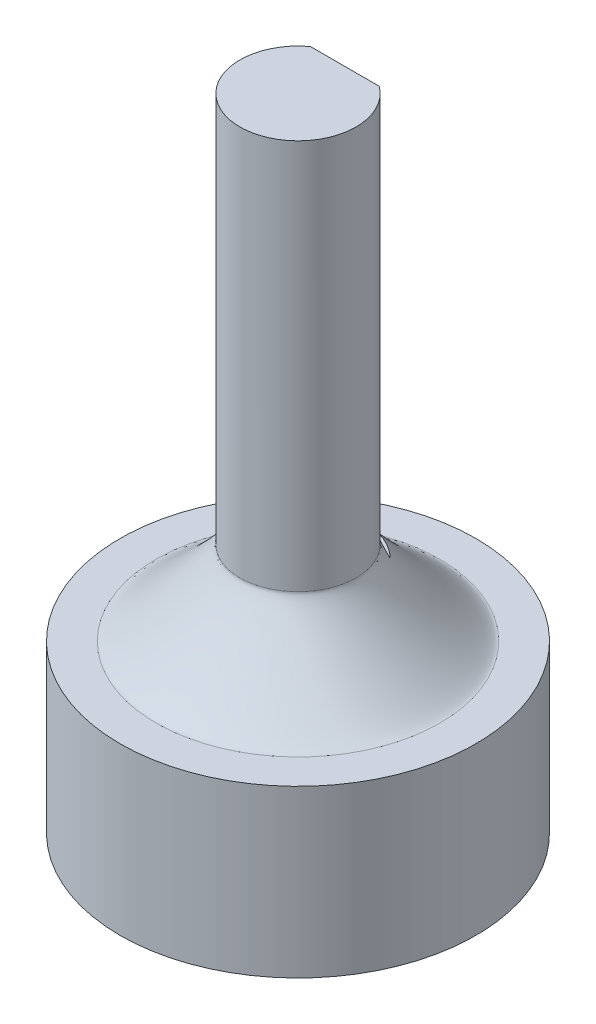
ISO-10303-21;
HEADER;
FILE_DESCRIPTION(('STEP AP214'),'2;1');
FILE_NAME('part.step','',(''),(''),'','','');
FILE_SCHEMA(('AUTOMOTIVE_DESIGN { 1 0 10303 214 1 1 1 1 }'));
ENDSEC;
DATA;
#1=APPLICATION_CONTEXT('core data for automotive mechanical design processes');
#2=APPLICATION_PROTOCOL_DEFINITION('international standard','automotive_design',2000,#1);
#3=PRODUCT_CONTEXT('',#1,'mechanical');
#4=PRODUCT('Part','Part','',(#3));
#5=PRODUCT_RELATED_PRODUCT_CATEGORY('part','',(#4));
#6=PRODUCT_DEFINITION_FORMATION('','',#4);
#7=PRODUCT_DEFINITION_CONTEXT('part definition',#1,'design');
#8=PRODUCT_DEFINITION('design','',#6,#7);
#9=PRODUCT_DEFINITION_SHAPE('','',#8);
#10=(LENGTH_UNIT() NAMED_UNIT(*) SI_UNIT(.MILLI.,.METRE.));
#11=(NAMED_UNIT(*) PLANE_ANGLE_UNIT() SI_UNIT($,.RADIAN.));
#12=(NAMED_UNIT(*) SI_UNIT($,.STERADIAN.) SOLID_ANGLE_UNIT());
#13=UNCERTAINTY_MEASURE_WITH_UNIT(LENGTH_MEASURE(1.E-05),#10,'distance_accuracy_value','');
#14=(GEOMETRIC_REPRESENTATION_CONTEXT(3) GLOBAL_UNCERTAINTY_ASSIGNED_CONTEXT((#13)) GLOBAL_UNIT_ASSIGNED_CONTEXT((#10,
#11,#12)) REPRESENTATION_CONTEXT('',''));
#15=CARTESIAN_POINT('',(0.,0.,0.));
#16=DIRECTION('',(0.,0.,1.));
#17=DIRECTION('',(1.,0.,0.));
#18=AXIS2_PLACEMENT_3D('',#15,#16,#17);
#19=CARTESIAN_POINT('',(-3.54245884228672,2.,-4.82468667270477));
#20=CARTESIAN_POINT('',(-2.91090883660745,2.,-5.28839344865424));
#21=CARTESIAN_POINT('',(-2.18740658779345,2.,-5.62634410096733));
#22=CARTESIAN_POINT('',(-0.665548538517678,2.,-5.9997950519732));
#23=CARTESIAN_POINT('',(0.132208496483373,2.,-6.03514841874369));
#24=CARTESIAN_POINT('',(1.68113549134606,2.,-5.7977822469065));
#25=CARTESIAN_POINT('',(2.43169603564322,2.,-5.52515609852376));
#26=CARTESIAN_POINT('',(3.77188188218393,2.,-4.71310965177444));
#27=CARTESIAN_POINT('',(4.36097989675496,2.,-4.17400884796719));
#28=CARTESIAN_POINT('',(5.28839344865458,2.,-2.91090883660626));
#29=CARTESIAN_POINT('',(5.62634410096693,2.,-2.18740658779251));
#30=CARTESIAN_POINT('',(5.99979505197361,2.,-0.665548538518613));
#31=CARTESIAN_POINT('',(6.03514841874339,2.,0.132208496483121));
#32=CARTESIAN_POINT('',(5.7977822469068,2.,1.68113549134632));
#33=CARTESIAN_POINT('',(5.52515609852315,2.,2.43169603564265));
#34=CARTESIAN_POINT('',(4.71310965177505,2.,3.7718818821845));
#35=CARTESIAN_POINT('',(4.17400884796728,2.,4.36097989675459));
#36=CARTESIAN_POINT('',(2.91090883660617,2.,5.28839344865495));
#37=CARTESIAN_POINT('',(2.18740658779261,2.,5.62634410096717));
#38=CARTESIAN_POINT('',(0.665548538518531,2.,5.99979505197336));
#39=CARTESIAN_POINT('',(-0.13220849648313,2.,6.03514841874323));
#40=CARTESIAN_POINT('',(-1.68113549134631,2.,5.79778224690695));
#41=CARTESIAN_POINT('',(-2.43169603564247,2.,5.52515609852281));
#42=CARTESIAN_POINT('',(-3.77188188218467,2.,4.71310965177539));
#43=CARTESIAN_POINT('',(-4.36097989675507,2.,4.17400884796725));
#44=CARTESIAN_POINT('',(-5.28839344865449,2.,2.91090883660618));
#45=CARTESIAN_POINT('',(-5.62634410096735,2.,2.1874065877926));
#46=CARTESIAN_POINT('',(-5.99979505197317,2.,0.665548538518547));
#47=CARTESIAN_POINT('',(-6.03514841874389,2.,-0.132208496483173));
#48=CARTESIAN_POINT('',(-5.7977822469063,2.,-1.68113549134623));
#49=CARTESIAN_POINT('',(-5.52515609852287,2.,-2.43169603564272));
#50=CARTESIAN_POINT('',(-4.71310965177533,2.,-3.77188188218441));
#51=CARTESIAN_POINT('',(-4.174008847966,2.,-4.36097989675531));
#52=CARTESIAN_POINT('',(-3.54245884228672,2.,-4.82468667270477));
#53=CARTESIAN_POINT('',(-1.45,2.,-1.97484176581315));
#54=CARTESIAN_POINT('',(-1.19149381855818,1.99999999999932,-2.16464632108444));
#55=CARTESIAN_POINT('',(-0.895349725574461,1.99999999999966,-2.30297635332165));
#56=CARTESIAN_POINT('',(-0.272422468069648,2.00000000000034,-2.45583737530355));
#57=CARTESIAN_POINT('',(0.0541156096473972,1.99999999999966,-2.47030822284155));
#58=CARTESIAN_POINT('',(0.688122733665404,2.00000000000034,-2.37314945135322));
#59=CARTESIAN_POINT('',(0.995342333859187,1.99999999999949,-2.26155805883305));
#60=CARTESIAN_POINT('',(1.54390748704849,2.00000000000051,-1.9291710360883));
#61=CARTESIAN_POINT('',(1.78503721054152,2.00000000000034,-1.70850618144233));
#62=CARTESIAN_POINT('',(2.16464632108478,1.99999999999966,-1.19149381855767));
#63=CARTESIAN_POINT('',(2.30297635332196,2.,-0.895349725574181));
#64=CARTESIAN_POINT('',(2.45583737530323,2.,-0.272422468069926));
#65=CARTESIAN_POINT('',(2.47030822284174,2.00000000000034,0.0541156096472936));
#66=CARTESIAN_POINT('',(2.37314945135304,1.99999999999966,0.688122733665511));
#67=CARTESIAN_POINT('',(2.26155805883312,1.99999999999949,0.995342333859115));
#68=CARTESIAN_POINT('',(1.92917103608824,2.00000000000051,1.54390748704856));
#69=CARTESIAN_POINT('',(1.70850618144284,2.,1.78503721054165));
#70=CARTESIAN_POINT('',(1.19149381855716,2.,2.16464632108465));
#71=CARTESIAN_POINT('',(0.89534972557428,2.,2.30297635332206));
#72=CARTESIAN_POINT('',(0.272422468069834,2.,2.45583737530313));
#73=CARTESIAN_POINT('',(-0.0541156096472479,2.00000000000068,2.47030822284184));
#74=CARTESIAN_POINT('',(-0.688122733665557,1.99999999999932,2.37314945135293));
#75=CARTESIAN_POINT('',(-0.995342333859451,1.99999999999949,2.26155805883329));
#76=CARTESIAN_POINT('',(-1.54390748704822,2.00000000000051,1.92917103608807));
#77=CARTESIAN_POINT('',(-1.785037210542,2.,1.70850618144267));
#78=CARTESIAN_POINT('',(-2.16464632108431,2.,1.19149381855732));
#79=CARTESIAN_POINT('',(-2.3029763533222,2.,0.895349725574387));
#80=CARTESIAN_POINT('',(-2.455837375303,2.,0.272422468069729));
#81=CARTESIAN_POINT('',(-2.47030822284163,1.99999999999966,-0.0541156096472029));
#82=CARTESIAN_POINT('',(-2.37314945135315,2.00000000000034,-0.688122733665584));
#83=CARTESIAN_POINT('',(-2.26155805883339,1.99999999999932,-0.995342333859317));
#84=CARTESIAN_POINT('',(-1.92917103608797,2.00000000000068,-1.54390748704835));
#85=CARTESIAN_POINT('',(-1.70850618144182,2.00000000000068,-1.78503721054186));
#86=CARTESIAN_POINT('',(-1.45,2.,-1.97484176581315));
#87=CARTESIAN_POINT('',(-1.45,5.53553390593274,-1.97484176581315));
#88=CARTESIAN_POINT('',(-1.19149381855798,5.53553390593274,-2.16464632108423));
#89=CARTESIAN_POINT('',(-0.895349725574511,5.53553390593274,-2.30297635332185));
#90=CARTESIAN_POINT('',(-0.272422468069598,5.53553390593274,-2.45583737530335));
#91=CARTESIAN_POINT('',(0.0541156096472806,5.53553390593274,-2.47030822284148));
#92=CARTESIAN_POINT('',(0.688122733665521,5.53553390593274,-2.37314945135329));
#93=CARTESIAN_POINT('',(0.995342333859261,5.5355339059324,-2.26155805883318));
#94=CARTESIAN_POINT('',(1.54390748704841,5.53553390593308,-1.92917103608818));
#95=CARTESIAN_POINT('',(1.78503721054175,5.53553390593308,-1.70850618144245));
#96=CARTESIAN_POINT('',(2.16464632108455,5.5355339059324,-1.19149381855755));
#97=CARTESIAN_POINT('',(2.30297635332192,5.5355339059324,-0.895349725574213));
#98=CARTESIAN_POINT('',(2.45583737530327,5.53553390593308,-0.272422468069894));
#99=CARTESIAN_POINT('',(2.47030822284148,5.53553390593308,0.0541156096472808));
#100=CARTESIAN_POINT('',(2.37314945135329,5.5355339059324,0.688122733665524));
#101=CARTESIAN_POINT('',(2.26155805883323,5.53553390593274,0.995342333859168));
#102=CARTESIAN_POINT('',(1.92917103608812,5.53553390593274,1.54390748704851));
#103=CARTESIAN_POINT('',(1.70850618144253,5.53553390593274,1.78503721054169));
#104=CARTESIAN_POINT('',(1.19149381855747,5.53553390593274,2.16464632108461));
#105=CARTESIAN_POINT('',(0.895349725574204,5.53553390593274,2.30297635332192));
#106=CARTESIAN_POINT('',(0.272422468069912,5.53553390593274,2.45583737530327));
#107=CARTESIAN_POINT('',(-0.0541156096472871,5.53553390593274,2.47030822284148));
#108=CARTESIAN_POINT('',(-0.688122733665518,5.53553390593274,2.37314945135329));
#109=CARTESIAN_POINT('',(-0.995342333859165,5.5355339059324,2.26155805883323));
#110=CARTESIAN_POINT('',(-1.5439074870485,5.53553390593308,1.92917103608812));
#111=CARTESIAN_POINT('',(-1.78503721054175,5.5355339059324,1.70850618144245));
#112=CARTESIAN_POINT('',(-2.16464632108455,5.53553390593308,1.19149381855755));
#113=CARTESIAN_POINT('',(-2.30297635332194,5.5355339059324,0.895349725574152));
#114=CARTESIAN_POINT('',(-2.45583737530326,5.53553390593308,0.272422468069964));
#115=CARTESIAN_POINT('',(-2.47030822284148,5.53553390593274,-0.0541156096472906));
#116=CARTESIAN_POINT('',(-2.3731494513533,5.53553390593274,-0.688122733665497));
#117=CARTESIAN_POINT('',(-2.2615580588332,5.5355339059324,-0.995342333859221));
#118=CARTESIAN_POINT('',(-1.92917103608816,5.53553390593308,-1.54390748704845));
#119=CARTESIAN_POINT('',(-1.70850618144202,5.53553390593274,-1.78503721054207));
#120=CARTESIAN_POINT('',(-1.45,5.53553390593274,-1.97484176581315));
#121=(BOUNDED_SURFACE() B_SPLINE_SURFACE(2,3,((#19,#20,#21,#22,#23,#24,#25,#26,#27,#28,#29,#30,
#31,#32,#33,#34,#35,#36,#37,#38,#39,#40,#41,#42,#43,#44,#45,#46,#47,#48,#49,#50,#51,#52),(#53,
#54,#55,#56,#57,#58,#59,#60,#61,#62,#63,#64,#65,#66,#67,#68,#69,#70,#71,#72,#73,#74,#75,#76,#77,
#78,#79,#80,#81,#82,#83,#84,#85,#86),(#87,#88,#89,#90,#91,#92,#93,#94,#95,#96,#97,#98,#99,#100,
#101,#102,#103,#104,#105,#106,#107,#108,#109,#110,#111,#112,#113,#114,#115,#116,#117,#118,#119,
#120)),.UNSPECIFIED.,.F.,.T.,.F.) B_SPLINE_SURFACE_WITH_KNOTS((3,3),(4,2,2,2,2,2,2,2,2,2,2,2,2,
2,2,2,4),(0.,1.),(-0.633335603311312,-0.240636521612588,0.152062560086137,0.544761641784861,
0.937460723483585,1.33015980518231,1.72285888688103,2.11555796857976,2.50825705027848,
2.90095613197721,3.29365521367593,3.68635429537465,4.07905337707338,4.4717524587721,
4.86445154047083,5.25715062216955,5.64984970386827),
.UNSPECIFIED.) GEOMETRIC_REPRESENTATION_ITEM() RATIONAL_B_SPLINE_SURFACE(((1.,1.,1.,1.,1.,1.,1.,
1.,1.,1.,1.,1.,1.,1.,1.,1.,1.,1.,1.,1.,1.,1.,1.,1.,1.,1.,1.,1.,1.,1.,1.,1.,1.,1.),(0.125,0.125,
0.125,0.125,0.125,0.125,0.125,0.125,0.125,0.125,0.125,0.125,0.125,0.125,0.125,0.125,0.125,0.125,
0.125,0.125,0.125,0.125,0.125,0.125,0.125,0.125,0.125,0.125,0.125,0.125,0.125,0.125,0.125,
0.125),(1.,1.,1.,1.,1.,1.,1.,1.,1.,1.,1.,1.,1.,1.,1.,1.,1.,1.,1.,1.,1.,1.,1.,1.,1.,1.,1.,1.,1.,
1.,1.,1.,1.,1.))) REPRESENTATION_ITEM('') SURFACE());
#122=CARTESIAN_POINT('',(-3.54245884228672,2.,-4.82468667270477));
#123=CARTESIAN_POINT('',(-4.174008847966,2.,-4.36097989675531));
#124=CARTESIAN_POINT('',(-4.71310965177533,2.,-3.77188188218441));
#125=CARTESIAN_POINT('',(-5.52515609852287,2.,-2.43169603564272));
#126=CARTESIAN_POINT('',(-5.7977822469063,2.,-1.68113549134623));
#127=CARTESIAN_POINT('',(-6.03514841874389,2.,-0.132208496483173));
#128=CARTESIAN_POINT('',(-5.99979505197317,2.,0.665548538518547));
#129=CARTESIAN_POINT('',(-5.62634410096735,2.,2.1874065877926));
#130=CARTESIAN_POINT('',(-5.28839344865449,2.,2.91090883660618));
#131=CARTESIAN_POINT('',(-4.36097989675507,2.,4.17400884796725));
#132=CARTESIAN_POINT('',(-3.77188188218467,2.,4.71310965177539));
#133=CARTESIAN_POINT('',(-2.43169603564247,2.,5.52515609852281));
#134=CARTESIAN_POINT('',(-1.68113549134631,2.,5.79778224690695));
#135=CARTESIAN_POINT('',(-0.13220849648313,2.,6.03514841874323));
#136=CARTESIAN_POINT('',(0.665548538518531,2.,5.99979505197336));
#137=CARTESIAN_POINT('',(2.18740658779261,2.,5.62634410096717));
#138=CARTESIAN_POINT('',(2.91090883660617,2.,5.28839344865495));
#139=CARTESIAN_POINT('',(4.17400884796728,2.,4.36097989675459));
#140=CARTESIAN_POINT('',(4.71310965177505,2.,3.7718818821845));
#141=CARTESIAN_POINT('',(5.52515609852315,2.,2.43169603564265));
#142=CARTESIAN_POINT('',(5.7977822469068,2.,1.68113549134632));
#143=CARTESIAN_POINT('',(6.03514841874339,2.,0.132208496483121));
#144=CARTESIAN_POINT('',(5.99979505197361,2.,-0.665548538518613));
#145=CARTESIAN_POINT('',(5.62634410096693,2.,-2.18740658779251));
#146=CARTESIAN_POINT('',(5.28839344865458,2.,-2.91090883660626));
#147=CARTESIAN_POINT('',(4.36097989675496,2.,-4.17400884796719));
#148=CARTESIAN_POINT('',(3.77188188218393,2.,-4.71310965177444));
#149=CARTESIAN_POINT('',(2.43169603564322,2.,-5.52515609852376));
#150=CARTESIAN_POINT('',(1.68113549134606,2.,-5.7977822469065));
#151=CARTESIAN_POINT('',(0.132208496483373,2.,-6.03514841874369));
#152=CARTESIAN_POINT('',(-0.665548538517678,2.,-5.9997950519732));
#153=CARTESIAN_POINT('',(-2.18740658779345,2.,-5.62634410096733));
#154=CARTESIAN_POINT('',(-2.91090883660745,2.,-5.28839344865424));
#155=CARTESIAN_POINT('',(-3.54245884228672,2.,-4.82468667270477));
#156=(BOUNDED_CURVE() B_SPLINE_CURVE(3,(#122,#123,#124,#125,#126,#127,#128,#129,#130,#131,#132,
#133,#134,#135,#136,#137,#138,#139,#140,#141,#142,#143,#144,#145,#146,#147,#148,#149,#150,#151,
#152,#153,#154,#155),.UNSPECIFIED.,.T.,.F.) B_SPLINE_CURVE_WITH_KNOTS((4,2,2,2,2,2,2,2,2,2,2,2,
2,2,2,2,4),(-0.633335603311312,-0.240636521612588,0.152062560086137,0.544761641784861,
0.937460723483585,1.33015980518231,1.72285888688103,2.11555796857976,2.50825705027848,
2.90095613197721,3.29365521367593,3.68635429537465,4.07905337707338,4.4717524587721,
4.86445154047083,5.25715062216955,5.64984970386827),
.UNSPECIFIED.) CURVE() GEOMETRIC_REPRESENTATION_ITEM() RATIONAL_B_SPLINE_CURVE((1.,1.,1.,1.,1.,
1.,1.,1.,1.,1.,1.,1.,1.,1.,1.,1.,1.,1.,1.,1.,1.,1.,1.,1.,1.,1.,1.,1.,1.,1.,1.,1.,1.,1.)) REPRESENTATION_ITEM(''));
#157=CARTESIAN_POINT('',(-3.54245884228672,2.,-4.82468667270477));
#158=VERTEX_POINT('',#157);
#159=EDGE_CURVE('E95',#158,#158,#156,.F.);
#160=CARTESIAN_POINT('',(1.91184602612636,5.,-1.97484176581315));
#161=CARTESIAN_POINT('',(1.88680357612926,5.02339623919845,-1.97484794887301));
#162=CARTESIAN_POINT('',(1.8618287081679,5.04686610739691,-1.97483242277833));
#163=CARTESIAN_POINT('',(1.81515989565718,5.09110053013634,-1.97481128158017));
#164=CARTESIAN_POINT('',(1.79344248675847,5.11184035915349,-1.97480467758503));
#165=CARTESIAN_POINT('',(1.74952796060595,5.15418321556764,-1.97483339058196));
#166=CARTESIAN_POINT('',(1.72733723724839,5.17579287674663,-1.97487003252018));
#167=CARTESIAN_POINT('',(1.67764088249705,5.2251582501401,-1.97480610985935));
#168=CARTESIAN_POINT('',(1.65026229867812,5.25304389274728,-1.97466717390624));
#169=CARTESIAN_POINT('',(1.6091585252585,5.29675089798885,-1.97433794888741));
#170=CARTESIAN_POINT('',(1.59499723963603,5.31216103811409,-1.97420147021734));
#171=CARTESIAN_POINT('',(1.56885640984317,5.34151284191463,-1.97396658116938));
#172=CARTESIAN_POINT('',(1.55682123491063,5.35540471815271,-1.97386555869407));
#173=CARTESIAN_POINT('',(1.53485303496427,5.38178768100575,-1.97372940709573));
#174=CARTESIAN_POINT('',(1.52485225032561,5.39422157073211,-1.97368733941689));
#175=CARTESIAN_POINT('',(1.51086709072542,5.41255565197234,-1.97368272781208));
#176=CARTESIAN_POINT('',(1.50662130856737,5.41825608796827,-1.97368902415611));
#177=CARTESIAN_POINT('',(1.49862277862797,5.42932743069636,-1.97371911165859));
#178=CARTESIAN_POINT('',(1.49485745032237,5.43468921166315,-1.973741495055));
#179=CARTESIAN_POINT('',(1.4878117645368,5.44509241847221,-1.97380202764636));
#180=CARTESIAN_POINT('',(1.48451696736338,5.45012401935043,-1.97383873209881));
#181=CARTESIAN_POINT('',(1.47840589450154,5.4598766381629,-1.97392512935442));
#182=CARTESIAN_POINT('',(1.47557284261243,5.46458710025476,-1.97397343187672));
#183=CARTESIAN_POINT('',(1.47037883879464,5.47370774891133,-1.97407931170528));
#184=CARTESIAN_POINT('',(1.46799835430137,5.47810668134957,-1.97413565896112));
#185=CARTESIAN_POINT('',(1.46470038356565,5.48464290853909,-1.97422568356153));
#186=CARTESIAN_POINT('',(1.46368223766855,5.48672953859014,-1.97425533737306));
#187=CARTESIAN_POINT('',(1.46175970647545,5.49082983188148,-1.97431495406849));
#188=CARTESIAN_POINT('',(1.46085218730617,5.49284202016597,-1.97434482962513));
#189=CARTESIAN_POINT('',(1.45915015565123,5.49679451550384,-1.97440419076644));
#190=CARTESIAN_POINT('',(1.45835225711912,5.49873335963194,-1.97443362062873));
#191=CARTESIAN_POINT('',(1.45686884449749,5.5025403281212,-1.97449133190098));
#192=CARTESIAN_POINT('',(1.4561796754099,5.50440702147104,-1.97451959541101));
#193=CARTESIAN_POINT('',(1.4549131083457,5.5080708162991,-1.97457416951046));
#194=CARTESIAN_POINT('',(1.45433178188604,5.50986655046165,-1.97460050571059));
#195=CARTESIAN_POINT('',(1.45328033671707,5.51338946798061,-1.97465037099128));
#196=CARTESIAN_POINT('',(1.45280601976821,5.51511538959881,-1.97467397481038));
#197=CARTESIAN_POINT('',(1.45196798632763,5.51849987928678,-1.97471748260183));
#198=CARTESIAN_POINT('',(1.45159982595356,5.52015732779611,-1.9747375146355));
#199=CARTESIAN_POINT('',(1.45112415316617,5.52262482464821,-1.97476441249167));
#200=CARTESIAN_POINT('',(1.45098056611556,5.5234279802828,-1.97477271361973));
#201=CARTESIAN_POINT('',(1.4507202530644,5.52501765659724,-1.9747880534123));
#202=CARTESIAN_POINT('',(1.4506029355839,5.5258040793526,-1.97479511886713));
#203=CARTESIAN_POINT('',(1.45039506875083,5.52736039650827,-1.97480786878089));
#204=CARTESIAN_POINT('',(1.45030392159153,5.52813021049421,-1.97481358344356));
#205=CARTESIAN_POINT('',(1.45014830573838,5.52965343814567,-1.97482350912342));
#206=CARTESIAN_POINT('',(1.45008323636543,5.53040678983594,-1.97482775364709));
#207=CARTESIAN_POINT('',(1.44997967824208,5.53189722552849,-1.97483461662928));
#208=CARTESIAN_POINT('',(1.44994059032394,5.53263426711393,-1.97483727159047));
#209=CARTESIAN_POINT('',(1.44988891104354,5.53409216742247,-1.97484082439642));
#210=CARTESIAN_POINT('',(1.44987572655151,5.53481300528498,-1.97484176154074));
#211=CARTESIAN_POINT('',(1.44987571596695,5.53553390593292,-1.97484176581315));
#212=B_SPLINE_CURVE_WITH_KNOTS('',3,(#160,#161,#162,#163,#164,#165,#166,#167,#168,#169,#170,
#171,#172,#173,#174,#175,#176,#177,#178,#179,#180,#181,#182,#183,#184,#185,#186,#187,#188,#189,
#190,#191,#192,#193,#194,#195,#196,#197,#198,#199,#200,#201,#202,#203,#204,#205,#206,#207,#208,
#209,#210,#211),.UNSPECIFIED.,.F.,.F.,(4,2,2,2,2,2,2,2,2,2,2,2,2,2,2,2,2,2,2,2,2,2,2,2,2,4),(0.,
0.102814504881268,0.192902764957441,0.285824298837191,0.403036605044378,0.465816776804255,
0.52094936939923,0.568803266455679,0.590124552232005,0.609777170607509,0.627816817335482,
0.644303356936106,0.659302376584984,0.666267384488883,0.672888981515966,0.679178145468736,
0.685146820344693,0.690808090968652,0.696176383400613,0.701267689698134,0.703715200940444,
0.706100314344898,0.708425579920389,0.710693691371368,0.712907492593485,0.71506998310197),.UNSPECIFIED.);
#213=CARTESIAN_POINT('',(1.45,5.53553390593276,-1.97484176581315));
#214=VERTEX_POINT('',#213);
#215=CARTESIAN_POINT('',(1.91184602612636,5.,-1.97484176581315));
#216=VERTEX_POINT('',#215);
#217=EDGE_CURVE('E12',#214,#216,#212,.F.);
#218=CARTESIAN_POINT('',(-1.45,5.53553390593274,-1.97484176581315));
#219=CARTESIAN_POINT('',(-1.19149381855798,5.53553390593274,-2.16464632108423));
#220=CARTESIAN_POINT('',(-0.895349725574511,5.53553390593274,-2.30297635332185));
#221=CARTESIAN_POINT('',(-0.272422468069598,5.53553390593274,-2.45583737530335));
#222=CARTESIAN_POINT('',(0.0541156096472806,5.53553390593274,-2.47030822284148));
#223=CARTESIAN_POINT('',(0.688122733665521,5.53553390593274,-2.37314945135329));
#224=CARTESIAN_POINT('',(0.995342333859261,5.5355339059324,-2.26155805883318));
#225=CARTESIAN_POINT('',(1.54390748704841,5.53553390593308,-1.92917103608818));
#226=CARTESIAN_POINT('',(1.78503721054175,5.53553390593308,-1.70850618144245));
#227=CARTESIAN_POINT('',(2.16464632108455,5.5355339059324,-1.19149381855755));
#228=CARTESIAN_POINT('',(2.30297635332192,5.5355339059324,-0.895349725574213));
#229=CARTESIAN_POINT('',(2.45583737530327,5.53553390593308,-0.272422468069894));
#230=CARTESIAN_POINT('',(2.47030822284148,5.53553390593308,0.0541156096472808));
#231=CARTESIAN_POINT('',(2.37314945135329,5.5355339059324,0.688122733665524));
#232=CARTESIAN_POINT('',(2.26155805883323,5.53553390593274,0.995342333859168));
#233=CARTESIAN_POINT('',(1.92917103608812,5.53553390593274,1.54390748704851));
#234=CARTESIAN_POINT('',(1.70850618144253,5.53553390593274,1.78503721054169));
#235=CARTESIAN_POINT('',(1.19149381855747,5.53553390593274,2.16464632108461));
#236=CARTESIAN_POINT('',(0.895349725574204,5.53553390593274,2.30297635332192));
#237=CARTESIAN_POINT('',(0.272422468069912,5.53553390593274,2.45583737530327));
#238=CARTESIAN_POINT('',(-0.0541156096472871,5.53553390593274,2.47030822284148));
#239=CARTESIAN_POINT('',(-0.688122733665518,5.53553390593274,2.37314945135329));
#240=CARTESIAN_POINT('',(-0.995342333859165,5.5355339059324,2.26155805883323));
#241=CARTESIAN_POINT('',(-1.5439074870485,5.53553390593308,1.92917103608812));
#242=CARTESIAN_POINT('',(-1.78503721054175,5.5355339059324,1.70850618144245));
#243=CARTESIAN_POINT('',(-2.16464632108455,5.53553390593308,1.19149381855755));
#244=CARTESIAN_POINT('',(-2.30297635332194,5.5355339059324,0.895349725574152));
#245=CARTESIAN_POINT('',(-2.45583737530326,5.53553390593308,0.272422468069964));
#246=CARTESIAN_POINT('',(-2.47030822284148,5.53553390593274,-0.0541156096472906));
#247=CARTESIAN_POINT('',(-2.3731494513533,5.53553390593274,-0.688122733665497));
#248=CARTESIAN_POINT('',(-2.2615580588332,5.5355339059324,-0.995342333859221));
#249=CARTESIAN_POINT('',(-1.92917103608816,5.53553390593308,-1.54390748704845));
#250=CARTESIAN_POINT('',(-1.70850618144202,5.53553390593274,-1.78503721054207));
#251=CARTESIAN_POINT('',(-1.45,5.53553390593274,-1.97484176581315));
#252=(BOUNDED_CURVE() B_SPLINE_CURVE(3,(#218,#219,#220,#221,#222,#223,#224,#225,#226,#227,#228,
#229,#230,#231,#232,#233,#234,#235,#236,#237,#238,#239,#240,#241,#242,#243,#244,#245,#246,#247,
#248,#249,#250,#251),.UNSPECIFIED.,.T.,.F.) B_SPLINE_CURVE_WITH_KNOTS((4,2,2,2,2,2,2,2,2,2,2,2,
2,2,2,2,4),(-0.633335603311312,-0.240636521612588,0.152062560086137,0.544761641784861,
0.937460723483585,1.33015980518231,1.72285888688103,2.11555796857976,2.50825705027848,
2.90095613197721,3.29365521367593,3.68635429537465,4.07905337707338,4.4717524587721,
4.86445154047083,5.25715062216955,5.64984970386827),
.UNSPECIFIED.) CURVE() GEOMETRIC_REPRESENTATION_ITEM() RATIONAL_B_SPLINE_CURVE((1.,1.,1.,1.,1.,
1.,1.,1.,1.,1.,1.,1.,1.,1.,1.,1.,1.,1.,1.,1.,1.,1.,1.,1.,1.,1.,1.,1.,1.,1.,1.,1.,1.,1.)) REPRESENTATION_ITEM(''));
#253=CARTESIAN_POINT('',(-1.45,5.53553390593274,-1.97484176581315));
#254=VERTEX_POINT('',#253);
#255=EDGE_CURVE('E99',#254,#214,#252,.F.);
#256=CARTESIAN_POINT('',(-1.45,5.53553390593274,-1.97484176581315));
#257=CARTESIAN_POINT('',(-1.45000001176557,5.53479501172475,-1.97484176124261));
#258=CARTESIAN_POINT('',(-1.45001379557765,5.53405618568171,-1.97484083230604));
#259=CARTESIAN_POINT('',(-1.45006780134479,5.53256156840017,-1.974837318411));
#260=CARTESIAN_POINT('',(-1.45010865575538,5.5318057998192,-1.97483469387551));
#261=CARTESIAN_POINT('',(-1.45021687738709,5.53027716506437,-1.9748279201267));
#262=CARTESIAN_POINT('',(-1.45028488324515,5.52950434495056,-1.97482373435986));
#263=CARTESIAN_POINT('',(-1.4504475076725,5.52794142726144,-1.97481395970987));
#264=CARTESIAN_POINT('',(-1.45054276610298,5.52715139690397,-1.97480833748856));
#265=CARTESIAN_POINT('',(-1.45075999603743,5.52555388668578,-1.97479581095335));
#266=CARTESIAN_POINT('',(-1.45088260382917,5.52474649394101,-1.97478887682638));
#267=CARTESIAN_POINT('',(-1.45115464407671,5.52311411138783,-1.97477384274969));
#268=CARTESIAN_POINT('',(-1.45130470550266,5.52228922751825,-1.97476571660961));
#269=CARTESIAN_POINT('',(-1.45180194196797,5.51975382133079,-1.97473941615071));
#270=CARTESIAN_POINT('',(-1.45218673321555,5.51805061006835,-1.97471988200091));
#271=CARTESIAN_POINT('',(-1.4530625431721,5.514571423633,-1.97467758780327));
#272=CARTESIAN_POINT('',(-1.45355827124332,5.51279665453346,-1.97465470890495));
#273=CARTESIAN_POINT('',(-1.45465712133548,5.50917281082167,-1.97460653621627));
#274=CARTESIAN_POINT('',(-1.45526468202361,5.50732509136142,-1.9745811788849));
#275=CARTESIAN_POINT('',(-1.45658836542963,5.50355405168417,-1.97452882583303));
#276=CARTESIAN_POINT('',(-1.45730863189511,5.50163219577429,-1.97450181700514));
#277=CARTESIAN_POINT('',(-1.45885895411346,5.49771158751901,-1.97444689408881));
#278=CARTESIAN_POINT('',(-1.45969285654265,5.49571436347374,-1.97441901105214));
#279=CARTESIAN_POINT('',(-1.46147167523852,5.49164175768771,-1.97436303316148));
#280=CARTESIAN_POINT('',(-1.46242014761224,5.48956793431969,-1.97433500725864));
#281=CARTESIAN_POINT('',(-1.46442943314205,5.48534099239709,-1.97427938488552));
#282=CARTESIAN_POINT('',(-1.46549353128442,5.4831894413127,-1.97425188855954));
#283=CARTESIAN_POINT('',(-1.46894142917367,5.47644617936539,-1.97416892568771));
#284=CARTESIAN_POINT('',(-1.47142937074776,5.47190759584441,-1.97411785243365));
#285=CARTESIAN_POINT('',(-1.4768578922109,5.46249349553846,-1.97402358488366));
#286=CARTESIAN_POINT('',(-1.47981884102627,5.45762986485451,-1.97398169534226));
#287=CARTESIAN_POINT('',(-1.48620590925973,5.44755663539702,-1.9739090260259));
#288=CARTESIAN_POINT('',(-1.48964948242342,5.44235815204988,-1.97387968263594));
#289=CARTESIAN_POINT('',(-1.49701344299854,5.43160683019398,-1.97383450144649));
#290=CARTESIAN_POINT('',(-1.50094882484625,5.42606431243958,-1.97382012022035));
#291=CARTESIAN_POINT('',(-1.5093087089248,5.41461712769415,-1.97380629334903));
#292=CARTESIAN_POINT('',(-1.51374625754497,5.4087220293511,-1.97380823027827));
#293=CARTESIAN_POINT('',(-1.52836626049884,5.38975445906392,-1.9738380558961));
#294=CARTESIAN_POINT('',(-1.53881825221344,5.37689015347354,-1.9738952703806));
#295=CARTESIAN_POINT('',(-1.56177786369151,5.34958813999902,-1.97405585916062));
#296=CARTESIAN_POINT('',(-1.57435562561503,5.33521021747401,-1.97416494898494));
#297=CARTESIAN_POINT('',(-1.60167444391009,5.30483016420963,-1.97440064500156));
#298=CARTESIAN_POINT('',(-1.61647315612447,5.28888011267909,-1.9745275779837));
#299=CARTESIAN_POINT('',(-1.65091532290269,5.25260587599242,-1.97475289146924));
#300=CARTESIAN_POINT('',(-1.67068370986026,5.23240058241061,-1.97483137052716));
#301=CARTESIAN_POINT('',(-1.69792341550745,5.20513369309867,-1.97484554580996));
#302=CARTESIAN_POINT('',(-1.70521462879756,5.19789036462017,-1.97484032350452));
#303=CARTESIAN_POINT('',(-1.73143211204277,5.17198252665023,-1.97482269673641));
#304=CARTESIAN_POINT('',(-1.75046720578108,5.15342797292992,-1.97481204087552));
#305=CARTESIAN_POINT('',(-1.79153889786554,5.11375672748384,-1.97480388241077));
#306=CARTESIAN_POINT('',(-1.81360224414342,5.0926678480468,-1.97480856317362));
#307=CARTESIAN_POINT('',(-1.86103369709834,5.04767979331106,-1.97482424522644));
#308=CARTESIAN_POINT('',(-1.88642642623327,5.02380654331137,-1.9748360492574));
#309=CARTESIAN_POINT('',(-1.91188045452628,5.,-1.97484176581315));
#310=B_SPLINE_CURVE_WITH_KNOTS('',3,(#256,#257,#258,#259,#260,#261,#262,#263,#264,#265,#266,
#267,#268,#269,#270,#271,#272,#273,#274,#275,#276,#277,#278,#279,#280,#281,#282,#283,#284,#285,
#286,#287,#288,#289,#290,#291,#292,#293,#294,#295,#296,#297,#298,#299,#300,#301,#302,#303,#304,
#305,#306,#307,#308,#309),.UNSPECIFIED.,.F.,.F.,(4,2,2,2,2,2,2,2,2,2,2,2,2,2,2,2,2,2,2,2,2,2,2,
2,2,2,4),(0.,0.0022164555062978,0.00448661157578769,0.00681364686557002,0.0092005706937674,
0.0116502291844069,0.0141653125806311,0.0194013260993928,0.0249278552303901,0.0307616633471907,
0.036917833361332,0.0434100138140934,0.0502506369549057,0.0574511076802723,0.0729717890167405,
0.0900497885040497,0.108752797956451,0.129142450843827,0.151275948745025,0.200984660103736,
0.258285646091487,0.323552635592188,0.408344649227455,0.43917723439184,0.518921262691833,
0.610483438098127,0.715040271034209),.UNSPECIFIED.);
#311=CARTESIAN_POINT('',(-1.91188045452628,5.,-1.97484176581315));
#312=VERTEX_POINT('',#311);
#313=EDGE_CURVE('E82',#312,#254,#310,.F.);
#314=CARTESIAN_POINT('',(-1.62685688261567,4.99999999999994,-2.21571373709655));
#315=CARTESIAN_POINT('',(-1.33682063401042,4.9999999999999,-2.42866880405836));
#316=CARTESIAN_POINT('',(-1.00455576786134,4.99999999999992,-2.58387098682951));
#317=CARTESIAN_POINT('',(-0.305649908384944,4.99999999999996,-2.75537650799795));
#318=CARTESIAN_POINT('',(0.060716104835617,4.99999999999992,-2.77161236862879));
#319=CARTESIAN_POINT('',(0.772053245067611,4.99999999999996,-2.66260311614462));
#320=CARTESIAN_POINT('',(1.11674450096395,4.99999999999962,-2.53740089203294));
#321=CARTESIAN_POINT('',(1.73221829063898,5.00000000000026,-2.1644725364157));
#322=CARTESIAN_POINT('',(2.00275867013442,5.00000000000025,-1.91689313122142));
#323=CARTESIAN_POINT('',(2.42866880405868,4.99999999999963,-1.33682063400991));
#324=CARTESIAN_POINT('',(2.58387098682956,4.99999999999965,-1.00455576786099));
#325=CARTESIAN_POINT('',(2.7553765079979,5.00000000000023,-0.305649908385294));
#326=CARTESIAN_POINT('',(2.77161236862878,5.00000000000025,0.060716104835589));
#327=CARTESIAN_POINT('',(2.66260311614463,4.99999999999963,0.772053245067643));
#328=CARTESIAN_POINT('',(2.53740089203294,4.99999999999991,1.11674450096382));
#329=CARTESIAN_POINT('',(2.1644725364157,4.99999999999998,1.73221829063911));
#330=CARTESIAN_POINT('',(1.91689313122153,4.99999999999994,2.00275867013435));
#331=CARTESIAN_POINT('',(1.33682063400981,4.99999999999994,2.42866880405875));
#332=CARTESIAN_POINT('',(1.004555767861,4.99999999999994,2.58387098682959));
#333=CARTESIAN_POINT('',(0.305649908385296,4.99999999999994,2.75537650799787));
#334=CARTESIAN_POINT('',(-0.0607161048355921,4.99999999999999,2.77161236862877));
#335=CARTESIAN_POINT('',(-0.77205324506764,4.9999999999999,2.66260311614464));
#336=CARTESIAN_POINT('',(-1.11674450096382,4.99999999999962,2.53740089203292));
#337=CARTESIAN_POINT('',(-1.7322182906391,5.00000000000026,2.16447253641572));
#338=CARTESIAN_POINT('',(-2.00275867013447,4.99999999999965,1.91689313122144));
#339=CARTESIAN_POINT('',(-2.42866880405864,5.00000000000023,1.33682063400988));
#340=CARTESIAN_POINT('',(-2.58387098682963,4.99999999999965,1.00455576786096));
#341=CARTESIAN_POINT('',(-2.75537650799783,5.00000000000023,0.305649908385334));
#342=CARTESIAN_POINT('',(-2.77161236862881,4.99999999999992,-0.0607161048355956));
#343=CARTESIAN_POINT('',(-2.6626031161446,4.99999999999996,-0.772053245067617));
#344=CARTESIAN_POINT('',(-2.5374008920329,4.99999999999961,-1.11674450096388));
#345=CARTESIAN_POINT('',(-2.16447253641574,5.00000000000028,-1.73221829063904));
#346=CARTESIAN_POINT('',(-1.91689313122092,4.99999999999999,-2.00275867013475));
#347=CARTESIAN_POINT('',(-1.62685688261567,4.99999999999994,-2.21571373709655));
#348=(BOUNDED_CURVE() B_SPLINE_CURVE(3,(#314,#315,#316,#317,#318,#319,#320,#321,#322,#323,#324,
#325,#326,#327,#328,#329,#330,#331,#332,#333,#334,#335,#336,#337,#338,#339,#340,#341,#342,#343,
#344,#345,#346,#347),.UNSPECIFIED.,.T.,.F.) B_SPLINE_CURVE_WITH_KNOTS((4,2,2,2,2,2,2,2,2,2,2,2,
2,2,2,2,4),(-0.633335603311312,-0.240636521612588,0.152062560086137,0.544761641784861,
0.937460723483585,1.33015980518231,1.72285888688103,2.11555796857976,2.50825705027848,
2.90095613197721,3.29365521367593,3.68635429537465,4.07905337707338,4.4717524587721,
4.86445154047083,5.25715062216955,5.64984970386827),
.UNSPECIFIED.) CURVE() GEOMETRIC_REPRESENTATION_ITEM() RATIONAL_B_SPLINE_CURVE((0.680894885266816,
0.680894885266816,0.680894885266816,0.680894885266816,0.680894885266816,0.680894885266816,
0.680894885266816,0.680894885266816,0.680894885266816,0.680894885266816,0.680894885266816,
0.680894885266816,0.680894885266816,0.680894885266816,0.680894885266816,0.680894885266816,
0.680894885266816,0.680894885266816,0.680894885266816,0.680894885266816,0.680894885266816,
0.680894885266816,0.680894885266816,0.680894885266816,0.680894885266816,0.680894885266816,
0.680894885266816,0.680894885266816,0.680894885266816,0.680894885266816,0.680894885266816,
0.680894885266816,0.680894885266816,0.680894885266816)) REPRESENTATION_ITEM(''));
#349=EDGE_CURVE('E53',#216,#312,#348,.F.);
#350=ORIENTED_EDGE('',*,*,#159,.F.);
#351=EDGE_LOOP('',(#350));
#352=FACE_BOUND('',#351,.T.);
#353=ORIENTED_EDGE('',*,*,#217,.F.);
#354=ORIENTED_EDGE('',*,*,#255,.F.);
#355=ORIENTED_EDGE('',*,*,#313,.F.);
#356=ORIENTED_EDGE('',*,*,#349,.F.);
#357=EDGE_LOOP('',(#353,#354,#355,#356));
#358=FACE_BOUND('',#357,.T.);
#359=ADVANCED_FACE('F41',(#352,#358),#121,.T.);
#360=CARTESIAN_POINT('',(0.,22.,0.));
#361=DIRECTION('',(0.,1.,0.));
#362=DIRECTION('',(0.,0.,1.));
#363=AXIS2_PLACEMENT_3D('',#360,#361,#362);
#364=PLANE('',#363);
#365=DIRECTION('',(1.,0.,0.));
#366=VECTOR('',#365,1.);
#367=CARTESIAN_POINT('',(-1.45,22.,-1.97484176581315));
#368=LINE('',#367,#366);
#369=CARTESIAN_POINT('',(-1.45,22.,-1.97484176581315));
#370=VERTEX_POINT('',#369);
#371=CARTESIAN_POINT('',(1.45,22.,-1.97484176581315));
#372=VERTEX_POINT('',#371);
#373=EDGE_CURVE('E79',#370,#372,#368,.T.);
#374=ORIENTED_EDGE('',*,*,#373,.F.);
#375=CARTESIAN_POINT('',(0.,22.,0.));
#376=DIRECTION('',(0.,-1.,0.));
#377=DIRECTION('',(0.,0.,-1.));
#378=AXIS2_PLACEMENT_3D('',#375,#376,#377);
#379=CIRCLE('',#378,2.45);
#380=EDGE_CURVE('E92',#372,#370,#379,.T.);
#381=ORIENTED_EDGE('',*,*,#380,.F.);
#382=EDGE_LOOP('',(#374,#381));
#383=FACE_BOUND('',#382,.T.);
#384=ADVANCED_FACE('F91',(#383),#364,.T.);
#385=CARTESIAN_POINT('',(0.,0.,0.));
#386=DIRECTION('',(0.,-1.,0.));
#387=DIRECTION('',(0.,0.,-1.));
#388=AXIS2_PLACEMENT_3D('',#385,#386,#387);
#389=CYLINDRICAL_SURFACE('',#388,2.45);
#390=DIRECTION('',(0.,1.,0.));
#391=VECTOR('',#390,1.);
#392=CARTESIAN_POINT('',(-1.45,5.,-1.97484176581315));
#393=LINE('',#392,#391);
#394=EDGE_CURVE('E75',#254,#370,#393,.T.);
#395=ORIENTED_EDGE('',*,*,#394,.F.);
#396=ORIENTED_EDGE('',*,*,#255,.T.);
#397=DIRECTION('',(0.,1.,0.));
#398=VECTOR('',#397,1.);
#399=CARTESIAN_POINT('',(1.45,5.,-1.97484176581315));
#400=LINE('',#399,#398);
#401=EDGE_CURVE('E88',#214,#372,#400,.T.);
#402=ORIENTED_EDGE('',*,*,#401,.T.);
#403=ORIENTED_EDGE('',*,*,#380,.T.);
#404=EDGE_LOOP('',(#395,#396,#402,#403));
#405=FACE_BOUND('',#404,.T.);
#406=ADVANCED_FACE('F94',(#405),#389,.T.);
#407=CARTESIAN_POINT('',(0.,2.,0.));
#408=DIRECTION('',(0.,-1.,0.));
#409=DIRECTION('',(0.,0.,-1.));
#410=AXIS2_PLACEMENT_3D('',#407,#408,#409);
#411=PLANE('',#410);
#412=ORIENTED_EDGE('',*,*,#159,.T.);
#413=EDGE_LOOP('',(#412));
#414=FACE_BOUND('',#413,.T.);
#415=CARTESIAN_POINT('',(0.,2.,0.));
#416=DIRECTION('',(0.,-1.,0.));
#417=DIRECTION('',(0.,0.,-1.));
#418=AXIS2_PLACEMENT_3D('',#415,#416,#417);
#419=CIRCLE('',#418,7.5);
#420=CARTESIAN_POINT('',(0.,2.,-7.5));
#421=VERTEX_POINT('',#420);
#422=EDGE_CURVE('E96',#421,#421,#419,.T.);
#423=ORIENTED_EDGE('',*,*,#422,.F.);
#424=EDGE_LOOP('',(#423));
#425=FACE_BOUND('',#424,.T.);
#426=ADVANCED_FACE('F113',(#414,#425),#411,.F.);
#427=CARTESIAN_POINT('',(0.,0.,0.));
#428=DIRECTION('',(0.,-1.,0.));
#429=DIRECTION('',(0.,0.,-1.));
#430=AXIS2_PLACEMENT_3D('',#427,#428,#429);
#431=CYLINDRICAL_SURFACE('',#430,7.5);
#432=CARTESIAN_POINT('',(0.,-5.,0.));
#433=DIRECTION('',(0.,-1.,0.));
#434=DIRECTION('',(0.,0.,-1.));
#435=AXIS2_PLACEMENT_3D('',#432,#433,#434);
#436=CIRCLE('',#435,7.5);
#437=CARTESIAN_POINT('',(0.,-5.,-7.5));
#438=VERTEX_POINT('',#437);
#439=EDGE_CURVE('E101',#438,#438,#436,.T.);
#440=ORIENTED_EDGE('',*,*,#439,.F.);
#441=EDGE_LOOP('',(#440));
#442=FACE_BOUND('',#441,.T.);
#443=ORIENTED_EDGE('',*,*,#422,.T.);
#444=EDGE_LOOP('',(#443));
#445=FACE_BOUND('',#444,.T.);
#446=ADVANCED_FACE('F123',(#442,#445),#431,.T.);
#447=CARTESIAN_POINT('',(0.,-5.,0.));
#448=DIRECTION('',(0.,1.,0.));
#449=DIRECTION('',(0.,0.,1.));
#450=AXIS2_PLACEMENT_3D('',#447,#448,#449);
#451=PLANE('',#450);
#452=CARTESIAN_POINT('',(0.,-5.,0.));
#453=DIRECTION('',(0.,-1.,0.));
#454=DIRECTION('',(0.,0.,-1.));
#455=AXIS2_PLACEMENT_3D('',#452,#453,#454);
#456=CIRCLE('',#455,4.5);
#457=CARTESIAN_POINT('',(0.,-5.,-4.5));
#458=VERTEX_POINT('',#457);
#459=EDGE_CURVE('E199',#458,#458,#456,.T.);
#460=ORIENTED_EDGE('',*,*,#459,.F.);
#461=EDGE_LOOP('',(#460));
#462=FACE_BOUND('',#461,.T.);
#463=ORIENTED_EDGE('',*,*,#439,.T.);
#464=EDGE_LOOP('',(#463));
#465=FACE_BOUND('',#464,.T.);
#466=ADVANCED_FACE('F209',(#462,#465),#451,.F.);
#467=CARTESIAN_POINT('',(0.,0.,0.));
#468=DIRECTION('',(0.,-1.,0.));
#469=DIRECTION('',(0.,0.,-1.));
#470=AXIS2_PLACEMENT_3D('',#467,#468,#469);
#471=CYLINDRICAL_SURFACE('',#470,4.5);
#472=CARTESIAN_POINT('',(0.,0.,0.));
#473=DIRECTION('',(0.,-1.,0.));
#474=DIRECTION('',(0.,0.,-1.));
#475=AXIS2_PLACEMENT_3D('',#472,#473,#474);
#476=CIRCLE('',#475,4.5);
#477=CARTESIAN_POINT('',(0.,0.,-4.5));
#478=VERTEX_POINT('',#477);
#479=EDGE_CURVE('E197',#478,#478,#476,.T.);
#480=ORIENTED_EDGE('',*,*,#479,.F.);
#481=EDGE_LOOP('',(#480));
#482=FACE_BOUND('',#481,.T.);
#483=ORIENTED_EDGE('',*,*,#459,.T.);
#484=EDGE_LOOP('',(#483));
#485=FACE_BOUND('',#484,.T.);
#486=ADVANCED_FACE('F218',(#482,#485),#471,.F.);
#487=CARTESIAN_POINT('',(0.,0.,0.));
#488=DIRECTION('',(0.,1.,0.));
#489=DIRECTION('',(0.,0.,1.));
#490=AXIS2_PLACEMENT_3D('',#487,#488,#489);
#491=PLANE('',#490);
#492=ORIENTED_EDGE('',*,*,#479,.T.);
#493=EDGE_LOOP('',(#492));
#494=FACE_BOUND('',#493,.T.);
#495=ADVANCED_FACE('F174',(#494),#491,.F.);
#496=CARTESIAN_POINT('',(-1.45,5.,-1.97484176581315));
#497=DIRECTION('',(0.,0.,1.));
#498=DIRECTION('',(1.,0.,0.));
#499=AXIS2_PLACEMENT_3D('',#496,#497,#498);
#500=PLANE('',#499);
#501=ORIENTED_EDGE('',*,*,#373,.T.);
#502=ORIENTED_EDGE('',*,*,#401,.F.);
#503=ORIENTED_EDGE('',*,*,#217,.T.);
#504=DIRECTION('',(1.,0.,0.));
#505=VECTOR('',#504,1.);
#506=CARTESIAN_POINT('',(-1.45,5.,-1.97484176581315));
#507=LINE('',#506,#505);
#508=EDGE_CURVE('E59',#312,#216,#507,.T.);
#509=ORIENTED_EDGE('',*,*,#508,.F.);
#510=ORIENTED_EDGE('',*,*,#313,.T.);
#511=ORIENTED_EDGE('',*,*,#394,.T.);
#512=EDGE_LOOP('',(#501,#502,#503,#509,#510,#511));
#513=FACE_BOUND('',#512,.T.);
#514=ADVANCED_FACE('F77',(#513),#500,.F.);
#515=CARTESIAN_POINT('',(0.,5.,0.));
#516=DIRECTION('',(0.,-1.,0.));
#517=DIRECTION('',(0.,0.,-1.));
#518=AXIS2_PLACEMENT_3D('',#515,#516,#517);
#519=PLANE('',#518);
#520=ORIENTED_EDGE('',*,*,#508,.T.);
#521=ORIENTED_EDGE('',*,*,#349,.T.);
#522=EDGE_LOOP('',(#520,#521));
#523=FACE_BOUND('',#522,.T.);
#524=ADVANCED_FACE('F173',(#523),#519,.F.);
#525=CLOSED_SHELL('',(#359,#384,#406,#426,#446,#466,#486,#495,#514,#524));
#526=MANIFOLD_SOLID_BREP('B2',#525);
#527=ADVANCED_BREP_SHAPE_REPRESENTATION('',(#18,#526),#14);
#528=SHAPE_DEFINITION_REPRESENTATION(#9,#527);
ENDSEC;
END-ISO-10303-21;
